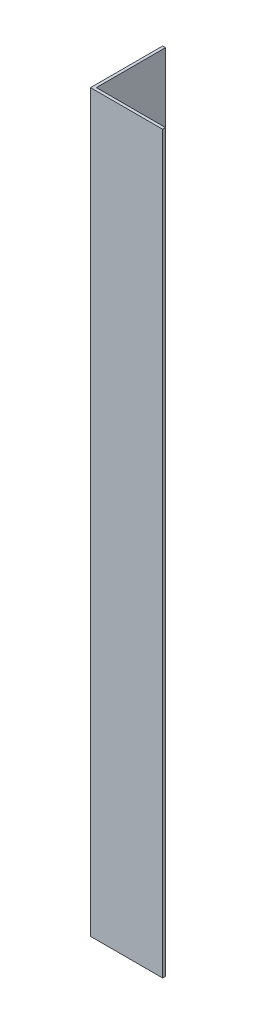
ISO-10303-21;
HEADER;
FILE_DESCRIPTION(('STEP AP214'),'2;1');
FILE_NAME('part.step','',(''),(''),'','','');
FILE_SCHEMA(('AUTOMOTIVE_DESIGN { 1 0 10303 214 1 1 1 1 }'));
ENDSEC;
DATA;
#1=APPLICATION_CONTEXT('core data for automotive mechanical design processes');
#2=APPLICATION_PROTOCOL_DEFINITION('international standard','automotive_design',2000,#1);
#3=PRODUCT_CONTEXT('',#1,'mechanical');
#4=PRODUCT('Part','Part','',(#3));
#5=PRODUCT_RELATED_PRODUCT_CATEGORY('part','',(#4));
#6=PRODUCT_DEFINITION_FORMATION('','',#4);
#7=PRODUCT_DEFINITION_CONTEXT('part definition',#1,'design');
#8=PRODUCT_DEFINITION('design','',#6,#7);
#9=PRODUCT_DEFINITION_SHAPE('','',#8);
#10=(LENGTH_UNIT() NAMED_UNIT(*) SI_UNIT(.MILLI.,.METRE.));
#11=(NAMED_UNIT(*) PLANE_ANGLE_UNIT() SI_UNIT($,.RADIAN.));
#12=(NAMED_UNIT(*) SI_UNIT($,.STERADIAN.) SOLID_ANGLE_UNIT());
#13=UNCERTAINTY_MEASURE_WITH_UNIT(LENGTH_MEASURE(1.E-05),#10,'distance_accuracy_value','');
#14=(GEOMETRIC_REPRESENTATION_CONTEXT(3) GLOBAL_UNCERTAINTY_ASSIGNED_CONTEXT((#13)) GLOBAL_UNIT_ASSIGNED_CONTEXT((#10,
#11,#12)) REPRESENTATION_CONTEXT('',''));
#15=CARTESIAN_POINT('',(0.,0.,0.));
#16=DIRECTION('',(0.,0.,1.));
#17=DIRECTION('',(1.,0.,0.));
#18=AXIS2_PLACEMENT_3D('',#15,#16,#17);
#19=CARTESIAN_POINT('',(0.,647.7,0.));
#20=DIRECTION('',(1.,0.,0.));
#21=DIRECTION('',(0.,0.,-1.));
#22=AXIS2_PLACEMENT_3D('',#19,#20,#21);
#23=PLANE('',#22);
#24=DIRECTION('',(0.,0.,1.));
#25=VECTOR('',#24,1.);
#26=CARTESIAN_POINT('',(0.,0.,0.));
#27=LINE('',#26,#25);
#28=CARTESIAN_POINT('',(0.,0.,-63.5));
#29=VERTEX_POINT('',#28);
#30=CARTESIAN_POINT('',(0.,0.,0.));
#31=VERTEX_POINT('',#30);
#32=EDGE_CURVE('E117',#29,#31,#27,.T.);
#33=ORIENTED_EDGE('',*,*,#32,.T.);
#34=DIRECTION('',(0.,-1.,0.));
#35=VECTOR('',#34,1.);
#36=CARTESIAN_POINT('',(0.,647.7,0.));
#37=LINE('',#36,#35);
#38=CARTESIAN_POINT('',(0.,647.7,0.));
#39=VERTEX_POINT('',#38);
#40=EDGE_CURVE('E11',#39,#31,#37,.T.);
#41=ORIENTED_EDGE('',*,*,#40,.F.);
#42=DIRECTION('',(0.,0.,1.));
#43=VECTOR('',#42,1.);
#44=CARTESIAN_POINT('',(0.,647.7,0.));
#45=LINE('',#44,#43);
#46=CARTESIAN_POINT('',(0.,647.7,-63.5));
#47=VERTEX_POINT('',#46);
#48=EDGE_CURVE('E127',#47,#39,#45,.T.);
#49=ORIENTED_EDGE('',*,*,#48,.F.);
#50=DIRECTION('',(0.,-1.,0.));
#51=VECTOR('',#50,1.);
#52=CARTESIAN_POINT('',(0.,647.7,-63.5));
#53=LINE('',#52,#51);
#54=EDGE_CURVE('E113',#47,#29,#53,.T.);
#55=ORIENTED_EDGE('',*,*,#54,.T.);
#56=EDGE_LOOP('',(#33,#41,#49,#55));
#57=FACE_BOUND('',#56,.T.);
#58=ADVANCED_FACE('F33',(#57),#23,.F.);
#59=CARTESIAN_POINT('',(0.,647.7,0.));
#60=DIRECTION('',(0.,0.,-1.));
#61=DIRECTION('',(-1.,0.,0.));
#62=AXIS2_PLACEMENT_3D('',#59,#60,#61);
#63=PLANE('',#62);
#64=DIRECTION('',(1.,0.,0.));
#65=VECTOR('',#64,1.);
#66=CARTESIAN_POINT('',(0.,0.,0.));
#67=LINE('',#66,#65);
#68=CARTESIAN_POINT('',(63.5,0.,0.));
#69=VERTEX_POINT('',#68);
#70=EDGE_CURVE('E120',#31,#69,#67,.T.);
#71=ORIENTED_EDGE('',*,*,#70,.T.);
#72=DIRECTION('',(0.,-1.,0.));
#73=VECTOR('',#72,1.);
#74=CARTESIAN_POINT('',(63.5,647.7,0.));
#75=LINE('',#74,#73);
#76=CARTESIAN_POINT('',(63.5,647.7,0.));
#77=VERTEX_POINT('',#76);
#78=EDGE_CURVE('E41',#77,#69,#75,.T.);
#79=ORIENTED_EDGE('',*,*,#78,.F.);
#80=DIRECTION('',(1.,0.,0.));
#81=VECTOR('',#80,1.);
#82=CARTESIAN_POINT('',(0.,647.7,0.));
#83=LINE('',#82,#81);
#84=EDGE_CURVE('E86',#39,#77,#83,.T.);
#85=ORIENTED_EDGE('',*,*,#84,.F.);
#86=ORIENTED_EDGE('',*,*,#40,.T.);
#87=EDGE_LOOP('',(#71,#79,#85,#86));
#88=FACE_BOUND('',#87,.T.);
#89=ADVANCED_FACE('F151',(#88),#63,.F.);
#90=CARTESIAN_POINT('',(63.5,647.7,0.));
#91=DIRECTION('',(-1.,0.,0.));
#92=DIRECTION('',(0.,0.,1.));
#93=AXIS2_PLACEMENT_3D('',#90,#91,#92);
#94=PLANE('',#93);
#95=DIRECTION('',(0.,0.,-1.));
#96=VECTOR('',#95,1.);
#97=CARTESIAN_POINT('',(63.5,0.,0.));
#98=LINE('',#97,#96);
#99=CARTESIAN_POINT('',(63.5,0.,-2.54));
#100=VERTEX_POINT('',#99);
#101=EDGE_CURVE('E122',#69,#100,#98,.T.);
#102=ORIENTED_EDGE('',*,*,#101,.T.);
#103=DIRECTION('',(0.,-1.,0.));
#104=VECTOR('',#103,1.);
#105=CARTESIAN_POINT('',(63.5,647.7,-2.54));
#106=LINE('',#105,#104);
#107=CARTESIAN_POINT('',(63.5,647.7,-2.54));
#108=VERTEX_POINT('',#107);
#109=EDGE_CURVE('E108',#108,#100,#106,.T.);
#110=ORIENTED_EDGE('',*,*,#109,.F.);
#111=DIRECTION('',(0.,0.,-1.));
#112=VECTOR('',#111,1.);
#113=CARTESIAN_POINT('',(63.5,647.7,0.));
#114=LINE('',#113,#112);
#115=EDGE_CURVE('E99',#77,#108,#114,.T.);
#116=ORIENTED_EDGE('',*,*,#115,.F.);
#117=ORIENTED_EDGE('',*,*,#78,.T.);
#118=EDGE_LOOP('',(#102,#110,#116,#117));
#119=FACE_BOUND('',#118,.T.);
#120=ADVANCED_FACE('F133',(#119),#94,.F.);
#121=CARTESIAN_POINT('',(63.5,647.7,-2.54));
#122=DIRECTION('',(0.,0.,1.));
#123=DIRECTION('',(1.,0.,0.));
#124=AXIS2_PLACEMENT_3D('',#121,#122,#123);
#125=PLANE('',#124);
#126=DIRECTION('',(-1.,0.,0.));
#127=VECTOR('',#126,1.);
#128=CARTESIAN_POINT('',(63.5,0.,-2.54));
#129=LINE('',#128,#127);
#130=CARTESIAN_POINT('',(2.54000000000001,0.,-2.53999999999999));
#131=VERTEX_POINT('',#130);
#132=EDGE_CURVE('E107',#100,#131,#129,.T.);
#133=ORIENTED_EDGE('',*,*,#132,.T.);
#134=DIRECTION('',(0.,-1.,0.));
#135=VECTOR('',#134,1.);
#136=CARTESIAN_POINT('',(2.54000000000001,647.7,-2.53999999999999));
#137=LINE('',#136,#135);
#138=CARTESIAN_POINT('',(2.54000000000001,647.7,-2.53999999999999));
#139=VERTEX_POINT('',#138);
#140=EDGE_CURVE('E104',#139,#131,#137,.T.);
#141=ORIENTED_EDGE('',*,*,#140,.F.);
#142=DIRECTION('',(-1.,0.,0.));
#143=VECTOR('',#142,1.);
#144=CARTESIAN_POINT('',(63.5,647.7,-2.54));
#145=LINE('',#144,#143);
#146=EDGE_CURVE('E93',#108,#139,#145,.T.);
#147=ORIENTED_EDGE('',*,*,#146,.F.);
#148=ORIENTED_EDGE('',*,*,#109,.T.);
#149=EDGE_LOOP('',(#133,#141,#147,#148));
#150=FACE_BOUND('',#149,.T.);
#151=ADVANCED_FACE('F105',(#150),#125,.F.);
#152=CARTESIAN_POINT('',(2.54,647.7,-63.5));
#153=DIRECTION('',(-1.,0.,0.));
#154=DIRECTION('',(0.,0.,1.));
#155=AXIS2_PLACEMENT_3D('',#152,#153,#154);
#156=PLANE('',#155);
#157=DIRECTION('',(0.,0.,-1.));
#158=VECTOR('',#157,1.);
#159=CARTESIAN_POINT('',(2.54,0.,-63.5));
#160=LINE('',#159,#158);
#161=CARTESIAN_POINT('',(2.54,0.,-63.5));
#162=VERTEX_POINT('',#161);
#163=EDGE_CURVE('E72',#131,#162,#160,.T.);
#164=ORIENTED_EDGE('',*,*,#163,.T.);
#165=DIRECTION('',(0.,-1.,0.));
#166=VECTOR('',#165,1.);
#167=CARTESIAN_POINT('',(2.54,647.7,-63.5));
#168=LINE('',#167,#166);
#169=CARTESIAN_POINT('',(2.54,647.7,-63.5));
#170=VERTEX_POINT('',#169);
#171=EDGE_CURVE('E109',#170,#162,#168,.T.);
#172=ORIENTED_EDGE('',*,*,#171,.F.);
#173=DIRECTION('',(0.,0.,-1.));
#174=VECTOR('',#173,1.);
#175=CARTESIAN_POINT('',(2.54,647.7,-63.5));
#176=LINE('',#175,#174);
#177=EDGE_CURVE('E97',#139,#170,#176,.T.);
#178=ORIENTED_EDGE('',*,*,#177,.F.);
#179=ORIENTED_EDGE('',*,*,#140,.T.);
#180=EDGE_LOOP('',(#164,#172,#178,#179));
#181=FACE_BOUND('',#180,.T.);
#182=ADVANCED_FACE('F111',(#181),#156,.F.);
#183=CARTESIAN_POINT('',(0.,647.7,-63.5));
#184=DIRECTION('',(0.,0.,1.));
#185=DIRECTION('',(1.,0.,0.));
#186=AXIS2_PLACEMENT_3D('',#183,#184,#185);
#187=PLANE('',#186);
#188=DIRECTION('',(-1.,0.,0.));
#189=VECTOR('',#188,1.);
#190=CARTESIAN_POINT('',(0.,0.,-63.5));
#191=LINE('',#190,#189);
#192=EDGE_CURVE('E78',#162,#29,#191,.T.);
#193=ORIENTED_EDGE('',*,*,#192,.T.);
#194=ORIENTED_EDGE('',*,*,#54,.F.);
#195=DIRECTION('',(-1.,0.,0.));
#196=VECTOR('',#195,1.);
#197=CARTESIAN_POINT('',(0.,647.7,-63.5));
#198=LINE('',#197,#196);
#199=EDGE_CURVE('E49',#170,#47,#198,.T.);
#200=ORIENTED_EDGE('',*,*,#199,.F.);
#201=ORIENTED_EDGE('',*,*,#171,.T.);
#202=EDGE_LOOP('',(#193,#194,#200,#201));
#203=FACE_BOUND('',#202,.T.);
#204=ADVANCED_FACE('F140',(#203),#187,.F.);
#205=CARTESIAN_POINT('',(0.,647.7,0.));
#206=DIRECTION('',(0.,-1.,0.));
#207=DIRECTION('',(0.,0.,-1.));
#208=AXIS2_PLACEMENT_3D('',#205,#206,#207);
#209=PLANE('',#208);
#210=ORIENTED_EDGE('',*,*,#48,.T.);
#211=ORIENTED_EDGE('',*,*,#84,.T.);
#212=ORIENTED_EDGE('',*,*,#115,.T.);
#213=ORIENTED_EDGE('',*,*,#146,.T.);
#214=ORIENTED_EDGE('',*,*,#177,.T.);
#215=ORIENTED_EDGE('',*,*,#199,.T.);
#216=EDGE_LOOP('',(#210,#211,#212,#213,#214,#215));
#217=FACE_BOUND('',#216,.T.);
#218=ADVANCED_FACE('F95',(#217),#209,.F.);
#219=CARTESIAN_POINT('',(0.,0.,0.));
#220=DIRECTION('',(0.,-1.,0.));
#221=DIRECTION('',(0.,0.,-1.));
#222=AXIS2_PLACEMENT_3D('',#219,#220,#221);
#223=PLANE('',#222);
#224=ORIENTED_EDGE('',*,*,#32,.F.);
#225=ORIENTED_EDGE('',*,*,#192,.F.);
#226=ORIENTED_EDGE('',*,*,#163,.F.);
#227=ORIENTED_EDGE('',*,*,#132,.F.);
#228=ORIENTED_EDGE('',*,*,#101,.F.);
#229=ORIENTED_EDGE('',*,*,#70,.F.);
#230=EDGE_LOOP('',(#224,#225,#226,#227,#228,#229));
#231=FACE_BOUND('',#230,.T.);
#232=ADVANCED_FACE('F136',(#231),#223,.T.);
#233=CLOSED_SHELL('',(#58,#89,#120,#151,#182,#204,#218,#232));
#234=MANIFOLD_SOLID_BREP('B2',#233);
#235=ADVANCED_BREP_SHAPE_REPRESENTATION('',(#18,#234),#14);
#236=SHAPE_DEFINITION_REPRESENTATION(#9,#235);
ENDSEC;
END-ISO-10303-21;
